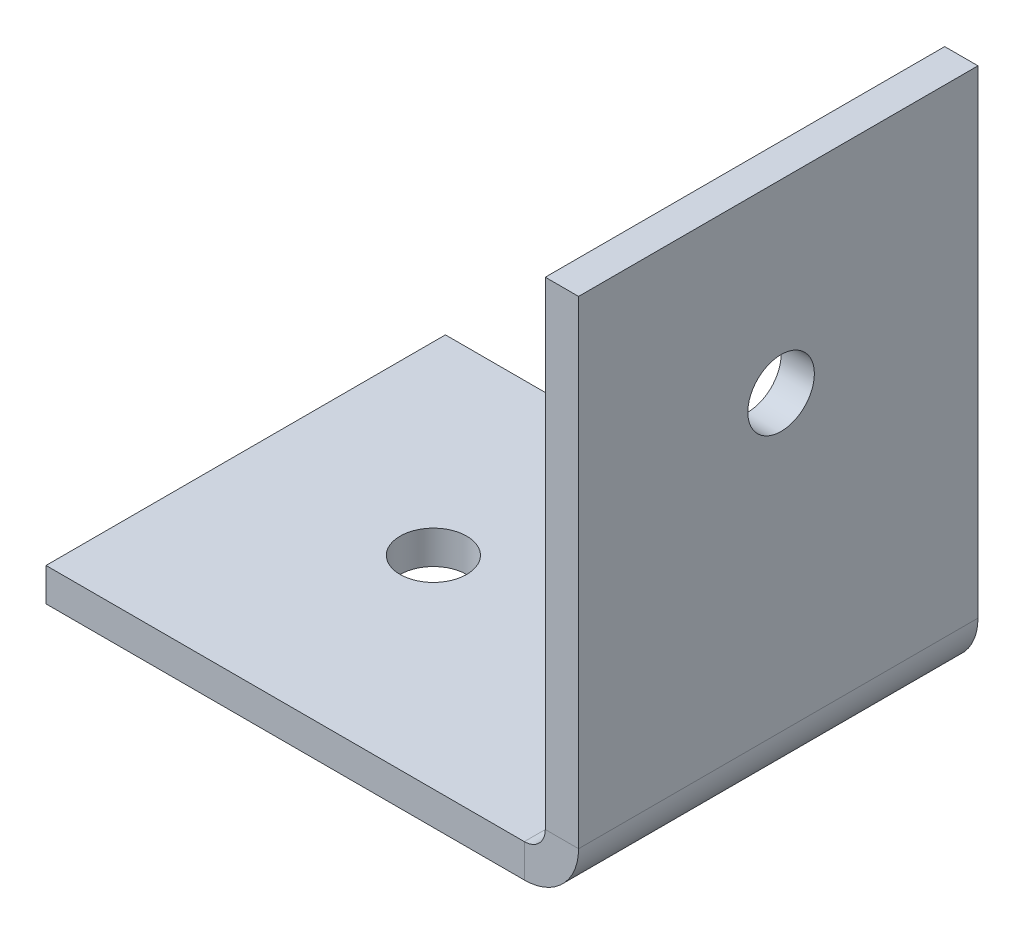
ISO-10303-21;
HEADER;
FILE_DESCRIPTION(('STEP AP214'),'2;1');
FILE_NAME('part.step','',(''),(''),'','','');
FILE_SCHEMA(('AUTOMOTIVE_DESIGN { 1 0 10303 214 1 1 1 1 }'));
ENDSEC;
DATA;
#1=APPLICATION_CONTEXT('core data for automotive mechanical design processes');
#2=APPLICATION_PROTOCOL_DEFINITION('international standard','automotive_design',2000,#1);
#3=PRODUCT_CONTEXT('',#1,'mechanical');
#4=PRODUCT('Part','Part','',(#3));
#5=PRODUCT_RELATED_PRODUCT_CATEGORY('part','',(#4));
#6=PRODUCT_DEFINITION_FORMATION('','',#4);
#7=PRODUCT_DEFINITION_CONTEXT('part definition',#1,'design');
#8=PRODUCT_DEFINITION('design','',#6,#7);
#9=PRODUCT_DEFINITION_SHAPE('','',#8);
#10=(LENGTH_UNIT() NAMED_UNIT(*) SI_UNIT(.MILLI.,.METRE.));
#11=(NAMED_UNIT(*) PLANE_ANGLE_UNIT() SI_UNIT($,.RADIAN.));
#12=(NAMED_UNIT(*) SI_UNIT($,.STERADIAN.) SOLID_ANGLE_UNIT());
#13=UNCERTAINTY_MEASURE_WITH_UNIT(LENGTH_MEASURE(1.E-05),#10,'distance_accuracy_value','');
#14=(GEOMETRIC_REPRESENTATION_CONTEXT(3) GLOBAL_UNCERTAINTY_ASSIGNED_CONTEXT((#13)) GLOBAL_UNIT_ASSIGNED_CONTEXT((#10,
#11,#12)) REPRESENTATION_CONTEXT('',''));
#15=CARTESIAN_POINT('',(0.,0.,0.));
#16=DIRECTION('',(0.,0.,1.));
#17=DIRECTION('',(1.,0.,0.));
#18=AXIS2_PLACEMENT_3D('',#15,#16,#17);
#19=CARTESIAN_POINT('',(0.,-1.5875,-19.05));
#20=DIRECTION('',(0.,0.,-1.));
#21=DIRECTION('',(-1.,0.,0.));
#22=AXIS2_PLACEMENT_3D('',#19,#20,#21);
#23=PLANE('',#22);
#24=DIRECTION('',(-1.,0.,0.));
#25=VECTOR('',#24,1.);
#26=CARTESIAN_POINT('',(0.,0.,-19.05));
#27=LINE('',#26,#25);
#28=CARTESIAN_POINT('',(22.8125,0.,-19.05));
#29=VERTEX_POINT('',#28);
#30=CARTESIAN_POINT('',(0.,0.,-19.05));
#31=VERTEX_POINT('',#30);
#32=EDGE_CURVE('E96',#29,#31,#27,.T.);
#33=ORIENTED_EDGE('',*,*,#32,.F.);
#34=DIRECTION('',(0.,-1.,0.));
#35=VECTOR('',#34,1.);
#36=CARTESIAN_POINT('',(22.8125,0.,-19.05));
#37=LINE('',#36,#35);
#38=CARTESIAN_POINT('',(22.8125,-1.5875,-19.05));
#39=VERTEX_POINT('',#38);
#40=EDGE_CURVE('E114',#29,#39,#37,.T.);
#41=ORIENTED_EDGE('',*,*,#40,.T.);
#42=DIRECTION('',(-1.,0.,0.));
#43=VECTOR('',#42,1.);
#44=CARTESIAN_POINT('',(0.,-1.5875,-19.05));
#45=LINE('',#44,#43);
#46=CARTESIAN_POINT('',(0.,-1.5875,-19.05));
#47=VERTEX_POINT('',#46);
#48=EDGE_CURVE('E81',#39,#47,#45,.T.);
#49=ORIENTED_EDGE('',*,*,#48,.T.);
#50=DIRECTION('',(0.,1.,0.));
#51=VECTOR('',#50,1.);
#52=CARTESIAN_POINT('',(0.,-1.5875,-19.05));
#53=LINE('',#52,#51);
#54=EDGE_CURVE('E13',#47,#31,#53,.T.);
#55=ORIENTED_EDGE('',*,*,#54,.T.);
#56=EDGE_LOOP('',(#33,#41,#49,#55));
#57=FACE_BOUND('',#56,.T.);
#58=ADVANCED_FACE('F58',(#57),#23,.T.);
#59=CARTESIAN_POINT('',(0.,-1.5875,0.));
#60=DIRECTION('',(0.,-1.,0.));
#61=DIRECTION('',(0.,0.,-1.));
#62=AXIS2_PLACEMENT_3D('',#59,#60,#61);
#63=PLANE('',#62);
#64=CARTESIAN_POINT('',(8.81789321881345,-1.5875,-9.65822334432932));
#65=DIRECTION('',(0.,-1.,0.));
#66=DIRECTION('',(0.,0.,-1.));
#67=AXIS2_PLACEMENT_3D('',#64,#65,#66);
#68=CIRCLE('',#67,1.58749999999999);
#69=CARTESIAN_POINT('',(8.81789321881345,-1.5875,-11.2457233443293));
#70=VERTEX_POINT('',#69);
#71=EDGE_CURVE('E181',#70,#70,#68,.T.);
#72=ORIENTED_EDGE('',*,*,#71,.F.);
#73=EDGE_LOOP('',(#72));
#74=FACE_BOUND('',#73,.T.);
#75=ORIENTED_EDGE('',*,*,#48,.F.);
#76=DIRECTION('',(0.,0.,-1.));
#77=VECTOR('',#76,1.);
#78=CARTESIAN_POINT('',(22.8125,-1.5875,-19.05));
#79=LINE('',#78,#77);
#80=CARTESIAN_POINT('',(22.8125,-1.5875,0.));
#81=VERTEX_POINT('',#80);
#82=EDGE_CURVE('E134',#39,#81,#79,.F.);
#83=ORIENTED_EDGE('',*,*,#82,.T.);
#84=DIRECTION('',(1.,0.,0.));
#85=VECTOR('',#84,1.);
#86=CARTESIAN_POINT('',(0.,-1.5875,0.));
#87=LINE('',#86,#85);
#88=CARTESIAN_POINT('',(0.,-1.5875,0.));
#89=VERTEX_POINT('',#88);
#90=EDGE_CURVE('E118',#89,#81,#87,.T.);
#91=ORIENTED_EDGE('',*,*,#90,.F.);
#92=DIRECTION('',(0.,0.,1.));
#93=VECTOR('',#92,1.);
#94=CARTESIAN_POINT('',(0.,-1.5875,0.));
#95=LINE('',#94,#93);
#96=EDGE_CURVE('E104',#47,#89,#95,.T.);
#97=ORIENTED_EDGE('',*,*,#96,.F.);
#98=EDGE_LOOP('',(#75,#83,#91,#97));
#99=FACE_BOUND('',#98,.T.);
#100=ADVANCED_FACE('F188',(#74,#99),#63,.T.);
#101=CARTESIAN_POINT('',(0.,0.,0.));
#102=DIRECTION('',(0.,-1.,0.));
#103=DIRECTION('',(0.,0.,-1.));
#104=AXIS2_PLACEMENT_3D('',#101,#102,#103);
#105=PLANE('',#104);
#106=CARTESIAN_POINT('',(8.81789321881345,0.,-9.65822334432932));
#107=DIRECTION('',(0.,-1.,0.));
#108=DIRECTION('',(0.,0.,-1.));
#109=AXIS2_PLACEMENT_3D('',#106,#107,#108);
#110=CIRCLE('',#109,1.58749999999999);
#111=CARTESIAN_POINT('',(8.81789321881345,0.,-11.2457233443293));
#112=VERTEX_POINT('',#111);
#113=EDGE_CURVE('E178',#112,#112,#110,.T.);
#114=ORIENTED_EDGE('',*,*,#113,.T.);
#115=EDGE_LOOP('',(#114));
#116=FACE_BOUND('',#115,.T.);
#117=DIRECTION('',(0.,0.,-1.));
#118=VECTOR('',#117,1.);
#119=CARTESIAN_POINT('',(22.8125,0.,-19.05));
#120=LINE('',#119,#118);
#121=CARTESIAN_POINT('',(22.8125,0.,0.));
#122=VERTEX_POINT('',#121);
#123=EDGE_CURVE('E103',#29,#122,#120,.F.);
#124=ORIENTED_EDGE('',*,*,#123,.F.);
#125=ORIENTED_EDGE('',*,*,#32,.T.);
#126=DIRECTION('',(0.,0.,1.));
#127=VECTOR('',#126,1.);
#128=CARTESIAN_POINT('',(0.,0.,0.));
#129=LINE('',#128,#127);
#130=CARTESIAN_POINT('',(0.,0.,0.));
#131=VERTEX_POINT('',#130);
#132=EDGE_CURVE('E100',#31,#131,#129,.T.);
#133=ORIENTED_EDGE('',*,*,#132,.T.);
#134=DIRECTION('',(1.,0.,0.));
#135=VECTOR('',#134,1.);
#136=CARTESIAN_POINT('',(0.,0.,0.));
#137=LINE('',#136,#135);
#138=EDGE_CURVE('E105',#131,#122,#137,.T.);
#139=ORIENTED_EDGE('',*,*,#138,.T.);
#140=EDGE_LOOP('',(#124,#125,#133,#139));
#141=FACE_BOUND('',#140,.T.);
#142=ADVANCED_FACE('F97',(#116,#141),#105,.F.);
#143=CARTESIAN_POINT('',(0.,-1.5875,0.));
#144=DIRECTION('',(-1.,0.,0.));
#145=DIRECTION('',(0.,0.,1.));
#146=AXIS2_PLACEMENT_3D('',#143,#144,#145);
#147=PLANE('',#146);
#148=ORIENTED_EDGE('',*,*,#132,.F.);
#149=ORIENTED_EDGE('',*,*,#54,.F.);
#150=ORIENTED_EDGE('',*,*,#96,.T.);
#151=DIRECTION('',(0.,1.,0.));
#152=VECTOR('',#151,1.);
#153=CARTESIAN_POINT('',(0.,-1.5875,0.));
#154=LINE('',#153,#152);
#155=EDGE_CURVE('E62',#89,#131,#154,.T.);
#156=ORIENTED_EDGE('',*,*,#155,.T.);
#157=EDGE_LOOP('',(#148,#149,#150,#156));
#158=FACE_BOUND('',#157,.T.);
#159=ADVANCED_FACE('F60',(#158),#147,.T.);
#160=CARTESIAN_POINT('',(0.,-1.5875,0.));
#161=DIRECTION('',(0.,0.,1.));
#162=DIRECTION('',(1.,0.,0.));
#163=AXIS2_PLACEMENT_3D('',#160,#161,#162);
#164=PLANE('',#163);
#165=DIRECTION('',(0.,-1.,0.));
#166=VECTOR('',#165,1.);
#167=CARTESIAN_POINT('',(22.8125,0.,0.));
#168=LINE('',#167,#166);
#169=EDGE_CURVE('E111',#122,#81,#168,.T.);
#170=ORIENTED_EDGE('',*,*,#169,.F.);
#171=ORIENTED_EDGE('',*,*,#138,.F.);
#172=ORIENTED_EDGE('',*,*,#155,.F.);
#173=ORIENTED_EDGE('',*,*,#90,.T.);
#174=EDGE_LOOP('',(#170,#171,#172,#173));
#175=FACE_BOUND('',#174,.T.);
#176=ADVANCED_FACE('F247',(#175),#164,.T.);
#177=CARTESIAN_POINT('',(22.8125,1.,0.));
#178=DIRECTION('',(0.,0.,1.));
#179=DIRECTION('',(1.,0.,0.));
#180=AXIS2_PLACEMENT_3D('',#177,#178,#179);
#181=PLANE('',#180);
#182=DIRECTION('',(-1.,0.,0.));
#183=VECTOR('',#182,1.);
#184=CARTESIAN_POINT('',(25.4,0.999999999999992,0.));
#185=LINE('',#184,#183);
#186=CARTESIAN_POINT('',(23.8125,0.999999999999997,0.));
#187=VERTEX_POINT('',#186);
#188=CARTESIAN_POINT('',(25.4,0.999999999999992,0.));
#189=VERTEX_POINT('',#188);
#190=EDGE_CURVE('E138',#187,#189,#185,.F.);
#191=ORIENTED_EDGE('',*,*,#190,.F.);
#192=CARTESIAN_POINT('',(22.8125,1.,0.));
#193=DIRECTION('',(0.,0.,-1.));
#194=DIRECTION('',(-1.,0.,0.));
#195=AXIS2_PLACEMENT_3D('',#192,#193,#194);
#196=CIRCLE('',#195,1.);
#197=EDGE_CURVE('E128',#122,#187,#196,.F.);
#198=ORIENTED_EDGE('',*,*,#197,.F.);
#199=ORIENTED_EDGE('',*,*,#169,.T.);
#200=CARTESIAN_POINT('',(22.8125,1.,0.));
#201=DIRECTION('',(0.,0.,-1.));
#202=DIRECTION('',(-1.,0.,0.));
#203=AXIS2_PLACEMENT_3D('',#200,#201,#202);
#204=CIRCLE('',#203,2.5875);
#205=EDGE_CURVE('E73',#81,#189,#204,.F.);
#206=ORIENTED_EDGE('',*,*,#205,.T.);
#207=EDGE_LOOP('',(#191,#198,#199,#206));
#208=FACE_BOUND('',#207,.T.);
#209=ADVANCED_FACE('F244',(#208),#181,.T.);
#210=CARTESIAN_POINT('',(22.8125,1.,-19.05));
#211=DIRECTION('',(0.,0.,1.));
#212=DIRECTION('',(1.,0.,0.));
#213=AXIS2_PLACEMENT_3D('',#210,#211,#212);
#214=PLANE('',#213);
#215=CARTESIAN_POINT('',(22.8125,1.,-19.05));
#216=DIRECTION('',(0.,0.,-1.));
#217=DIRECTION('',(-1.,0.,0.));
#218=AXIS2_PLACEMENT_3D('',#215,#216,#217);
#219=CIRCLE('',#218,1.);
#220=CARTESIAN_POINT('',(23.8125,0.999999999999997,-19.05));
#221=VERTEX_POINT('',#220);
#222=EDGE_CURVE('E123',#221,#29,#219,.T.);
#223=ORIENTED_EDGE('',*,*,#222,.F.);
#224=DIRECTION('',(-1.,0.,0.));
#225=VECTOR('',#224,1.);
#226=CARTESIAN_POINT('',(23.8125,0.999999999999997,-19.05));
#227=LINE('',#226,#225);
#228=CARTESIAN_POINT('',(25.4,0.999999999999992,-19.05));
#229=VERTEX_POINT('',#228);
#230=EDGE_CURVE('E145',#221,#229,#227,.F.);
#231=ORIENTED_EDGE('',*,*,#230,.T.);
#232=CARTESIAN_POINT('',(22.8125,1.,-19.05));
#233=DIRECTION('',(0.,0.,-1.));
#234=DIRECTION('',(-1.,0.,0.));
#235=AXIS2_PLACEMENT_3D('',#232,#233,#234);
#236=CIRCLE('',#235,2.5875);
#237=EDGE_CURVE('E131',#229,#39,#236,.T.);
#238=ORIENTED_EDGE('',*,*,#237,.T.);
#239=ORIENTED_EDGE('',*,*,#40,.F.);
#240=EDGE_LOOP('',(#223,#231,#238,#239));
#241=FACE_BOUND('',#240,.T.);
#242=ADVANCED_FACE('F217',(#241),#214,.F.);
#243=CARTESIAN_POINT('',(22.8125,1.,-19.05));
#244=DIRECTION('',(0.,0.,-1.));
#245=DIRECTION('',(1.,0.,0.));
#246=AXIS2_PLACEMENT_3D('',#243,#244,#245);
#247=CYLINDRICAL_SURFACE('',#246,2.5875);
#248=ORIENTED_EDGE('',*,*,#82,.F.);
#249=ORIENTED_EDGE('',*,*,#237,.F.);
#250=DIRECTION('',(0.,0.,-1.));
#251=VECTOR('',#250,1.);
#252=CARTESIAN_POINT('',(25.4,0.999999999999992,0.));
#253=LINE('',#252,#251);
#254=EDGE_CURVE('E148',#229,#189,#253,.F.);
#255=ORIENTED_EDGE('',*,*,#254,.T.);
#256=ORIENTED_EDGE('',*,*,#205,.F.);
#257=EDGE_LOOP('',(#248,#249,#255,#256));
#258=FACE_BOUND('',#257,.T.);
#259=ADVANCED_FACE('F242',(#258),#247,.T.);
#260=CARTESIAN_POINT('',(22.8125,1.,-19.05));
#261=DIRECTION('',(0.,0.,-1.));
#262=DIRECTION('',(1.,0.,0.));
#263=AXIS2_PLACEMENT_3D('',#260,#261,#262);
#264=CYLINDRICAL_SURFACE('',#263,1.);
#265=ORIENTED_EDGE('',*,*,#123,.T.);
#266=ORIENTED_EDGE('',*,*,#197,.T.);
#267=DIRECTION('',(0.,0.,-1.));
#268=VECTOR('',#267,1.);
#269=CARTESIAN_POINT('',(23.8125,0.999999999999997,0.));
#270=LINE('',#269,#268);
#271=EDGE_CURVE('E141',#187,#221,#270,.T.);
#272=ORIENTED_EDGE('',*,*,#271,.T.);
#273=ORIENTED_EDGE('',*,*,#222,.T.);
#274=EDGE_LOOP('',(#265,#266,#272,#273));
#275=FACE_BOUND('',#274,.T.);
#276=ADVANCED_FACE('F210',(#275),#264,.F.);
#277=CARTESIAN_POINT('',(25.4,0.,0.));
#278=DIRECTION('',(0.,0.,-1.));
#279=DIRECTION('',(-1.,0.,0.));
#280=AXIS2_PLACEMENT_3D('',#277,#278,#279);
#281=PLANE('',#280);
#282=ORIENTED_EDGE('',*,*,#190,.T.);
#283=DIRECTION('',(0.,-1.,0.));
#284=VECTOR('',#283,1.);
#285=CARTESIAN_POINT('',(25.4,0.,0.));
#286=LINE('',#285,#284);
#287=CARTESIAN_POINT('',(25.4000000000001,23.8125,0.));
#288=VERTEX_POINT('',#287);
#289=EDGE_CURVE('E159',#288,#189,#286,.T.);
#290=ORIENTED_EDGE('',*,*,#289,.F.);
#291=DIRECTION('',(-1.,0.,0.));
#292=VECTOR('',#291,1.);
#293=CARTESIAN_POINT('',(25.4000000000001,23.8125,0.));
#294=LINE('',#293,#292);
#295=CARTESIAN_POINT('',(23.8125000000001,23.8125,0.));
#296=VERTEX_POINT('',#295);
#297=EDGE_CURVE('E168',#288,#296,#294,.T.);
#298=ORIENTED_EDGE('',*,*,#297,.T.);
#299=DIRECTION('',(0.,1.,0.));
#300=VECTOR('',#299,1.);
#301=CARTESIAN_POINT('',(23.8125,0.,0.));
#302=LINE('',#301,#300);
#303=EDGE_CURVE('E150',#296,#187,#302,.F.);
#304=ORIENTED_EDGE('',*,*,#303,.T.);
#305=EDGE_LOOP('',(#282,#290,#298,#304));
#306=FACE_BOUND('',#305,.T.);
#307=ADVANCED_FACE('F237',(#306),#281,.F.);
#308=CARTESIAN_POINT('',(25.4000000000001,23.8125,-19.05));
#309=DIRECTION('',(0.,0.,1.));
#310=DIRECTION('',(1.,0.,0.));
#311=AXIS2_PLACEMENT_3D('',#308,#309,#310);
#312=PLANE('',#311);
#313=ORIENTED_EDGE('',*,*,#230,.F.);
#314=DIRECTION('',(0.,-1.,0.));
#315=VECTOR('',#314,1.);
#316=CARTESIAN_POINT('',(23.8125000000001,23.8125,-19.05));
#317=LINE('',#316,#315);
#318=CARTESIAN_POINT('',(23.8125000000001,23.8125,-19.05));
#319=VERTEX_POINT('',#318);
#320=EDGE_CURVE('E153',#221,#319,#317,.F.);
#321=ORIENTED_EDGE('',*,*,#320,.T.);
#322=DIRECTION('',(-1.,0.,0.));
#323=VECTOR('',#322,1.);
#324=CARTESIAN_POINT('',(25.4000000000001,23.8125,-19.05));
#325=LINE('',#324,#323);
#326=CARTESIAN_POINT('',(25.4000000000001,23.8125,-19.05));
#327=VERTEX_POINT('',#326);
#328=EDGE_CURVE('E126',#327,#319,#325,.T.);
#329=ORIENTED_EDGE('',*,*,#328,.F.);
#330=DIRECTION('',(0.,1.,0.));
#331=VECTOR('',#330,1.);
#332=CARTESIAN_POINT('',(25.4,0.,-19.05));
#333=LINE('',#332,#331);
#334=EDGE_CURVE('E162',#229,#327,#333,.T.);
#335=ORIENTED_EDGE('',*,*,#334,.F.);
#336=EDGE_LOOP('',(#313,#321,#329,#335));
#337=FACE_BOUND('',#336,.T.);
#338=ADVANCED_FACE('F222',(#337),#312,.F.);
#339=CARTESIAN_POINT('',(25.4,0.,0.));
#340=DIRECTION('',(-1.,0.,0.));
#341=DIRECTION('',(0.,-1.,0.));
#342=AXIS2_PLACEMENT_3D('',#339,#340,#341);
#343=PLANE('',#342);
#344=CARTESIAN_POINT('',(25.4000000000001,14.9946067811864,-9.65822334432936));
#345=DIRECTION('',(1.,0.,0.));
#346=DIRECTION('',(0.,0.,-1.));
#347=AXIS2_PLACEMENT_3D('',#344,#345,#346);
#348=CIRCLE('',#347,1.58749999999999);
#349=CARTESIAN_POINT('',(25.4000000000001,14.9946067811864,-11.2457233443293));
#350=VERTEX_POINT('',#349);
#351=EDGE_CURVE('E175',#350,#350,#348,.T.);
#352=ORIENTED_EDGE('',*,*,#351,.F.);
#353=EDGE_LOOP('',(#352));
#354=FACE_BOUND('',#353,.T.);
#355=ORIENTED_EDGE('',*,*,#254,.F.);
#356=ORIENTED_EDGE('',*,*,#334,.T.);
#357=DIRECTION('',(0.,0.,1.));
#358=VECTOR('',#357,1.);
#359=CARTESIAN_POINT('',(25.4000000000001,23.8125,0.));
#360=LINE('',#359,#358);
#361=EDGE_CURVE('E165',#327,#288,#360,.T.);
#362=ORIENTED_EDGE('',*,*,#361,.T.);
#363=ORIENTED_EDGE('',*,*,#289,.T.);
#364=EDGE_LOOP('',(#355,#356,#362,#363));
#365=FACE_BOUND('',#364,.T.);
#366=ADVANCED_FACE('F240',(#354,#365),#343,.F.);
#367=CARTESIAN_POINT('',(23.8125,0.,0.));
#368=DIRECTION('',(-1.,0.,0.));
#369=DIRECTION('',(0.,-1.,0.));
#370=AXIS2_PLACEMENT_3D('',#367,#368,#369);
#371=PLANE('',#370);
#372=CARTESIAN_POINT('',(23.8125000000001,14.9946067811864,-9.65822334432936));
#373=DIRECTION('',(-1.,0.,0.));
#374=DIRECTION('',(0.,-1.,0.));
#375=AXIS2_PLACEMENT_3D('',#372,#373,#374);
#376=CIRCLE('',#375,1.58749999999999);
#377=CARTESIAN_POINT('',(23.8125,13.4071067811864,-9.65822334432936));
#378=VERTEX_POINT('',#377);
#379=EDGE_CURVE('E142',#378,#378,#376,.T.);
#380=ORIENTED_EDGE('',*,*,#379,.F.);
#381=EDGE_LOOP('',(#380));
#382=FACE_BOUND('',#381,.T.);
#383=ORIENTED_EDGE('',*,*,#320,.F.);
#384=ORIENTED_EDGE('',*,*,#271,.F.);
#385=ORIENTED_EDGE('',*,*,#303,.F.);
#386=DIRECTION('',(0.,0.,-1.));
#387=VECTOR('',#386,1.);
#388=CARTESIAN_POINT('',(23.8125000000001,23.8125,0.));
#389=LINE('',#388,#387);
#390=EDGE_CURVE('E156',#319,#296,#389,.F.);
#391=ORIENTED_EDGE('',*,*,#390,.F.);
#392=EDGE_LOOP('',(#383,#384,#385,#391));
#393=FACE_BOUND('',#392,.T.);
#394=ADVANCED_FACE('F226',(#382,#393),#371,.T.);
#395=CARTESIAN_POINT('',(25.4000000000001,23.8125,0.));
#396=DIRECTION('',(0.,-1.,0.));
#397=DIRECTION('',(1.,0.,0.));
#398=AXIS2_PLACEMENT_3D('',#395,#396,#397);
#399=PLANE('',#398);
#400=ORIENTED_EDGE('',*,*,#390,.T.);
#401=ORIENTED_EDGE('',*,*,#297,.F.);
#402=ORIENTED_EDGE('',*,*,#361,.F.);
#403=ORIENTED_EDGE('',*,*,#328,.T.);
#404=EDGE_LOOP('',(#400,#401,#402,#403));
#405=FACE_BOUND('',#404,.T.);
#406=ADVANCED_FACE('F231',(#405),#399,.F.);
#407=CARTESIAN_POINT('',(25.4000000000001,14.9946067811864,-9.65822334432936));
#408=DIRECTION('',(1.,0.,0.));
#409=DIRECTION('',(0.,0.,-1.));
#410=AXIS2_PLACEMENT_3D('',#407,#408,#409);
#411=CYLINDRICAL_SURFACE('',#410,1.58749999999999);
#412=ORIENTED_EDGE('',*,*,#379,.T.);
#413=EDGE_LOOP('',(#412));
#414=FACE_BOUND('',#413,.T.);
#415=ORIENTED_EDGE('',*,*,#351,.T.);
#416=EDGE_LOOP('',(#415));
#417=FACE_BOUND('',#416,.T.);
#418=ADVANCED_FACE('F274',(#414,#417),#411,.F.);
#419=CARTESIAN_POINT('',(8.81789321881345,-1.5875,-9.65822334432932));
#420=DIRECTION('',(0.,-1.,0.));
#421=DIRECTION('',(0.,0.,-1.));
#422=AXIS2_PLACEMENT_3D('',#419,#420,#421);
#423=CYLINDRICAL_SURFACE('',#422,1.58749999999999);
#424=ORIENTED_EDGE('',*,*,#71,.T.);
#425=EDGE_LOOP('',(#424));
#426=FACE_BOUND('',#425,.T.);
#427=ORIENTED_EDGE('',*,*,#113,.F.);
#428=EDGE_LOOP('',(#427));
#429=FACE_BOUND('',#428,.T.);
#430=ADVANCED_FACE('F185',(#426,#429),#423,.F.);
#431=CLOSED_SHELL('',(#58,#100,#142,#159,#176,#209,#242,#259,#276,#307,#338,#366,#394,#406,#418,#430));
#432=MANIFOLD_SOLID_BREP('B2',#431);
#433=ADVANCED_BREP_SHAPE_REPRESENTATION('',(#18,#432),#14);
#434=SHAPE_DEFINITION_REPRESENTATION(#9,#433);
ENDSEC;
END-ISO-10303-21;
